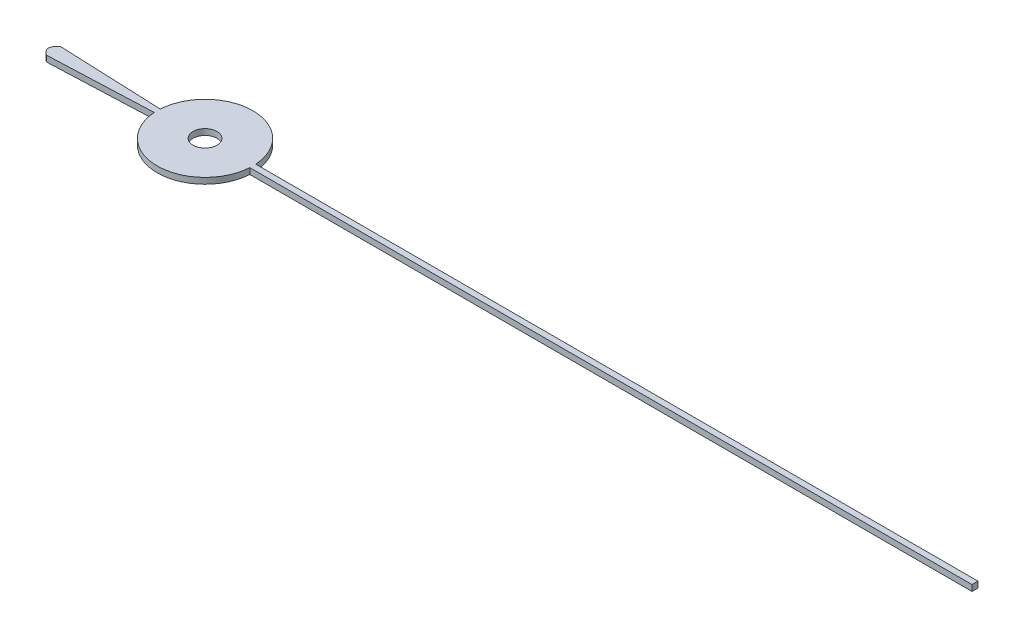
ISO-10303-21;
HEADER;
FILE_DESCRIPTION(('STEP AP214'),'2;1');
FILE_NAME('part.step','',(''),(''),'','','');
FILE_SCHEMA(('AUTOMOTIVE_DESIGN { 1 0 10303 214 1 1 1 1 }'));
ENDSEC;
DATA;
#1=APPLICATION_CONTEXT('core data for automotive mechanical design processes');
#2=APPLICATION_PROTOCOL_DEFINITION('international standard','automotive_design',2000,#1);
#3=PRODUCT_CONTEXT('',#1,'mechanical');
#4=PRODUCT('Part','Part','',(#3));
#5=PRODUCT_RELATED_PRODUCT_CATEGORY('part','',(#4));
#6=PRODUCT_DEFINITION_FORMATION('','',#4);
#7=PRODUCT_DEFINITION_CONTEXT('part definition',#1,'design');
#8=PRODUCT_DEFINITION('design','',#6,#7);
#9=PRODUCT_DEFINITION_SHAPE('','',#8);
#10=(LENGTH_UNIT() NAMED_UNIT(*) SI_UNIT(.MILLI.,.METRE.));
#11=(NAMED_UNIT(*) PLANE_ANGLE_UNIT() SI_UNIT($,.RADIAN.));
#12=(NAMED_UNIT(*) SI_UNIT($,.STERADIAN.) SOLID_ANGLE_UNIT());
#13=UNCERTAINTY_MEASURE_WITH_UNIT(LENGTH_MEASURE(1.E-05),#10,'distance_accuracy_value','');
#14=(GEOMETRIC_REPRESENTATION_CONTEXT(3) GLOBAL_UNCERTAINTY_ASSIGNED_CONTEXT((#13)) GLOBAL_UNIT_ASSIGNED_CONTEXT((#10,
#11,#12)) REPRESENTATION_CONTEXT('',''));
#15=CARTESIAN_POINT('',(0.,0.,0.));
#16=DIRECTION('',(0.,0.,1.));
#17=DIRECTION('',(1.,0.,0.));
#18=AXIS2_PLACEMENT_3D('',#15,#16,#17);
#19=CARTESIAN_POINT('',(-12.6777359801288,0.5,0.606260641219378));
#20=CARTESIAN_POINT('',(-13.5337899445866,0.5,0.));
#21=CARTESIAN_POINT('',(-12.6777359801288,0.5,-0.606260641219378));
#22=B_SPLINE_CURVE_WITH_KNOTS('',2,(#19,#20,#21),.UNSPECIFIED.,.F.,.F.,(3,3),(0.,1.),.UNSPECIFIED.);
#23=DIRECTION('',(0.,-1.,0.));
#24=VECTOR('',#23,1.);
#25=SURFACE_OF_LINEAR_EXTRUSION('',#22,#24);
#26=CARTESIAN_POINT('',(-12.6777359801288,0.,0.606260641219378));
#27=CARTESIAN_POINT('',(-13.5337899445866,0.,0.));
#28=CARTESIAN_POINT('',(-12.6777359801288,0.,-0.606260641219378));
#29=B_SPLINE_CURVE_WITH_KNOTS('',2,(#26,#27,#28),.UNSPECIFIED.,.F.,.F.,(3,3),(0.,1.),.UNSPECIFIED.);
#30=CARTESIAN_POINT('',(-12.6777359801288,0.,0.606260641219378));
#31=VERTEX_POINT('',#30);
#32=CARTESIAN_POINT('',(-12.6777359801288,0.,-0.606260641219378));
#33=VERTEX_POINT('',#32);
#34=EDGE_CURVE('E133',#31,#33,#29,.T.);
#35=ORIENTED_EDGE('',*,*,#34,.F.);
#36=DIRECTION('',(0.,-1.,0.));
#37=VECTOR('',#36,1.);
#38=CARTESIAN_POINT('',(-12.6777359801288,0.5,0.606260641219378));
#39=LINE('',#38,#37);
#40=CARTESIAN_POINT('',(-12.6777359801288,0.5,0.606260641219378));
#41=VERTEX_POINT('',#40);
#42=EDGE_CURVE('E11',#41,#31,#39,.T.);
#43=ORIENTED_EDGE('',*,*,#42,.F.);
#44=CARTESIAN_POINT('',(-12.6777359801288,0.5,-0.606260641219378));
#45=VERTEX_POINT('',#44);
#46=EDGE_CURVE('E155',#41,#45,#22,.T.);
#47=ORIENTED_EDGE('',*,*,#46,.T.);
#48=DIRECTION('',(0.,-1.,0.));
#49=VECTOR('',#48,1.);
#50=CARTESIAN_POINT('',(-12.6777359801288,0.5,-0.606260641219378));
#51=LINE('',#50,#49);
#52=EDGE_CURVE('E53',#45,#33,#51,.T.);
#53=ORIENTED_EDGE('',*,*,#52,.T.);
#54=EDGE_LOOP('',(#35,#43,#47,#53));
#55=FACE_BOUND('',#54,.T.);
#56=ADVANCED_FACE('F36',(#55),#25,.T.);
#57=CARTESIAN_POINT('',(0.00351580652269543,0.5,0.0856374160691493));
#58=DIRECTION('',(-0.041020006425208,0.,-0.999158325328311));
#59=DIRECTION('',(-0.999158325328312,0.,0.0410200064252081));
#60=AXIS2_PLACEMENT_3D('',#57,#58,#59);
#61=PLANE('',#60);
#62=DIRECTION('',(0.999158325328312,0.,-0.0410200064252081));
#63=VECTOR('',#62,1.);
#64=CARTESIAN_POINT('',(0.00351580652269543,0.,0.0856374160691493));
#65=LINE('',#64,#63);
#66=CARTESIAN_POINT('',(-4.,0.,0.25));
#67=VERTEX_POINT('',#66);
#68=EDGE_CURVE('E137',#31,#67,#65,.T.);
#69=ORIENTED_EDGE('',*,*,#68,.T.);
#70=DIRECTION('',(0.,-1.,0.));
#71=VECTOR('',#70,1.);
#72=CARTESIAN_POINT('',(-4.,0.5,0.25));
#73=LINE('',#72,#71);
#74=CARTESIAN_POINT('',(-4.,0.5,0.25));
#75=VERTEX_POINT('',#74);
#76=EDGE_CURVE('E45',#75,#67,#73,.T.);
#77=ORIENTED_EDGE('',*,*,#76,.F.);
#78=DIRECTION('',(0.999158325328312,0.,-0.0410200064252081));
#79=VECTOR('',#78,1.);
#80=CARTESIAN_POINT('',(0.00351580652269543,0.5,0.0856374160691493));
#81=LINE('',#80,#79);
#82=EDGE_CURVE('E265',#41,#75,#81,.T.);
#83=ORIENTED_EDGE('',*,*,#82,.F.);
#84=ORIENTED_EDGE('',*,*,#42,.T.);
#85=EDGE_LOOP('',(#69,#77,#83,#84));
#86=FACE_BOUND('',#85,.T.);
#87=ADVANCED_FACE('F195',(#86),#61,.F.);
#88=CARTESIAN_POINT('',(0.,0.5,0.));
#89=DIRECTION('',(0.,-1.,0.));
#90=DIRECTION('',(0.,0.,-1.));
#91=AXIS2_PLACEMENT_3D('',#88,#89,#90);
#92=CYLINDRICAL_SURFACE('',#91,4.00780488547035);
#93=CARTESIAN_POINT('',(0.,0.,0.));
#94=DIRECTION('',(0.,1.,0.));
#95=DIRECTION('',(0.,0.,1.));
#96=AXIS2_PLACEMENT_3D('',#93,#94,#95);
#97=CIRCLE('',#96,4.00780488547035);
#98=CARTESIAN_POINT('',(4.,0.,0.25));
#99=VERTEX_POINT('',#98);
#100=EDGE_CURVE('E143',#67,#99,#97,.T.);
#101=ORIENTED_EDGE('',*,*,#100,.T.);
#102=DIRECTION('',(0.,-1.,0.));
#103=VECTOR('',#102,1.);
#104=CARTESIAN_POINT('',(4.,0.5,0.25));
#105=LINE('',#104,#103);
#106=CARTESIAN_POINT('',(4.,0.5,0.25));
#107=VERTEX_POINT('',#106);
#108=EDGE_CURVE('E162',#107,#99,#105,.T.);
#109=ORIENTED_EDGE('',*,*,#108,.F.);
#110=CARTESIAN_POINT('',(0.,0.5,0.));
#111=DIRECTION('',(0.,1.,0.));
#112=DIRECTION('',(0.,0.,1.));
#113=AXIS2_PLACEMENT_3D('',#110,#111,#112);
#114=CIRCLE('',#113,4.00780488547035);
#115=EDGE_CURVE('E121',#75,#107,#114,.T.);
#116=ORIENTED_EDGE('',*,*,#115,.F.);
#117=ORIENTED_EDGE('',*,*,#76,.T.);
#118=EDGE_LOOP('',(#101,#109,#116,#117));
#119=FACE_BOUND('',#118,.T.);
#120=ADVANCED_FACE('F169',(#119),#92,.T.);
#121=CARTESIAN_POINT('',(0.,0.5,0.25));
#122=DIRECTION('',(0.,0.,-1.));
#123=DIRECTION('',(-1.,0.,0.));
#124=AXIS2_PLACEMENT_3D('',#121,#122,#123);
#125=PLANE('',#124);
#126=DIRECTION('',(1.,0.,0.));
#127=VECTOR('',#126,1.);
#128=CARTESIAN_POINT('',(0.,0.,0.25));
#129=LINE('',#128,#127);
#130=CARTESIAN_POINT('',(64.4873131542784,0.,0.25));
#131=VERTEX_POINT('',#130);
#132=EDGE_CURVE('E145',#99,#131,#129,.T.);
#133=ORIENTED_EDGE('',*,*,#132,.T.);
#134=DIRECTION('',(0.,-1.,0.));
#135=VECTOR('',#134,1.);
#136=CARTESIAN_POINT('',(64.4873131542784,0.5,0.25));
#137=LINE('',#136,#135);
#138=CARTESIAN_POINT('',(64.4873131542784,0.5,0.25));
#139=VERTEX_POINT('',#138);
#140=EDGE_CURVE('E159',#139,#131,#137,.T.);
#141=ORIENTED_EDGE('',*,*,#140,.F.);
#142=DIRECTION('',(1.,0.,0.));
#143=VECTOR('',#142,1.);
#144=CARTESIAN_POINT('',(0.,0.5,0.25));
#145=LINE('',#144,#143);
#146=EDGE_CURVE('E128',#107,#139,#145,.T.);
#147=ORIENTED_EDGE('',*,*,#146,.F.);
#148=ORIENTED_EDGE('',*,*,#108,.T.);
#149=EDGE_LOOP('',(#133,#141,#147,#148));
#150=FACE_BOUND('',#149,.T.);
#151=ADVANCED_FACE('F179',(#150),#125,.F.);
#152=CARTESIAN_POINT('',(64.4873131542784,0.5,0.));
#153=DIRECTION('',(-1.,0.,0.));
#154=DIRECTION('',(0.,0.,1.));
#155=AXIS2_PLACEMENT_3D('',#152,#153,#154);
#156=PLANE('',#155);
#157=DIRECTION('',(0.,0.,-1.));
#158=VECTOR('',#157,1.);
#159=CARTESIAN_POINT('',(64.4873131542784,0.,0.));
#160=LINE('',#159,#158);
#161=CARTESIAN_POINT('',(64.4873131542784,0.,-0.25));
#162=VERTEX_POINT('',#161);
#163=EDGE_CURVE('E148',#131,#162,#160,.T.);
#164=ORIENTED_EDGE('',*,*,#163,.T.);
#165=DIRECTION('',(0.,-1.,0.));
#166=VECTOR('',#165,1.);
#167=CARTESIAN_POINT('',(64.4873131542784,0.5,-0.25));
#168=LINE('',#167,#166);
#169=CARTESIAN_POINT('',(64.4873131542784,0.5,-0.25));
#170=VERTEX_POINT('',#169);
#171=EDGE_CURVE('E113',#170,#162,#168,.T.);
#172=ORIENTED_EDGE('',*,*,#171,.F.);
#173=DIRECTION('',(0.,0.,-1.));
#174=VECTOR('',#173,1.);
#175=CARTESIAN_POINT('',(64.4873131542784,0.5,0.));
#176=LINE('',#175,#174);
#177=EDGE_CURVE('E125',#139,#170,#176,.T.);
#178=ORIENTED_EDGE('',*,*,#177,.F.);
#179=ORIENTED_EDGE('',*,*,#140,.T.);
#180=EDGE_LOOP('',(#164,#172,#178,#179));
#181=FACE_BOUND('',#180,.T.);
#182=ADVANCED_FACE('F182',(#181),#156,.F.);
#183=CARTESIAN_POINT('',(0.,0.5,-0.25));
#184=DIRECTION('',(0.,0.,-1.));
#185=DIRECTION('',(-1.,0.,0.));
#186=AXIS2_PLACEMENT_3D('',#183,#184,#185);
#187=PLANE('',#186);
#188=DIRECTION('',(1.,0.,0.));
#189=VECTOR('',#188,1.);
#190=CARTESIAN_POINT('',(0.,0.,-0.25));
#191=LINE('',#190,#189);
#192=CARTESIAN_POINT('',(4.,0.,-0.25));
#193=VERTEX_POINT('',#192);
#194=EDGE_CURVE('E110',#193,#162,#191,.T.);
#195=ORIENTED_EDGE('',*,*,#194,.F.);
#196=DIRECTION('',(0.,-1.,0.));
#197=VECTOR('',#196,1.);
#198=CARTESIAN_POINT('',(4.,0.5,-0.25));
#199=LINE('',#198,#197);
#200=CARTESIAN_POINT('',(4.,0.5,-0.25));
#201=VERTEX_POINT('',#200);
#202=EDGE_CURVE('E104',#201,#193,#199,.T.);
#203=ORIENTED_EDGE('',*,*,#202,.F.);
#204=DIRECTION('',(1.,0.,0.));
#205=VECTOR('',#204,1.);
#206=CARTESIAN_POINT('',(0.,0.5,-0.25));
#207=LINE('',#206,#205);
#208=EDGE_CURVE('E108',#201,#170,#207,.T.);
#209=ORIENTED_EDGE('',*,*,#208,.T.);
#210=ORIENTED_EDGE('',*,*,#171,.T.);
#211=EDGE_LOOP('',(#195,#203,#209,#210));
#212=FACE_BOUND('',#211,.T.);
#213=ADVANCED_FACE('F106',(#212),#187,.T.);
#214=CARTESIAN_POINT('',(-4.,0.,-0.25));
#215=VERTEX_POINT('',#214);
#216=EDGE_CURVE('E146',#193,#215,#97,.T.);
#217=ORIENTED_EDGE('',*,*,#216,.T.);
#218=DIRECTION('',(0.,-1.,0.));
#219=VECTOR('',#218,1.);
#220=CARTESIAN_POINT('',(-4.,0.5,-0.25));
#221=LINE('',#220,#219);
#222=CARTESIAN_POINT('',(-4.,0.5,-0.25));
#223=VERTEX_POINT('',#222);
#224=EDGE_CURVE('E79',#223,#215,#221,.T.);
#225=ORIENTED_EDGE('',*,*,#224,.F.);
#226=EDGE_CURVE('E115',#201,#223,#114,.T.);
#227=ORIENTED_EDGE('',*,*,#226,.F.);
#228=ORIENTED_EDGE('',*,*,#202,.T.);
#229=EDGE_LOOP('',(#217,#225,#227,#228));
#230=FACE_BOUND('',#229,.T.);
#231=ADVANCED_FACE('F116',(#230),#92,.T.);
#232=CARTESIAN_POINT('',(0.00351580652269543,0.5,-0.0856374160691493));
#233=DIRECTION('',(0.041020006425208,0.,-0.999158325328311));
#234=DIRECTION('',(-0.999158325328312,0.,-0.0410200064252081));
#235=AXIS2_PLACEMENT_3D('',#232,#233,#234);
#236=PLANE('',#235);
#237=DIRECTION('',(0.999158325328312,0.,0.0410200064252081));
#238=VECTOR('',#237,1.);
#239=CARTESIAN_POINT('',(0.00351580652269543,0.,-0.0856374160691493));
#240=LINE('',#239,#238);
#241=EDGE_CURVE('E152',#33,#215,#240,.T.);
#242=ORIENTED_EDGE('',*,*,#241,.F.);
#243=ORIENTED_EDGE('',*,*,#52,.F.);
#244=DIRECTION('',(0.999158325328312,0.,0.0410200064252081));
#245=VECTOR('',#244,1.);
#246=CARTESIAN_POINT('',(0.00351580652269543,0.5,-0.0856374160691493));
#247=LINE('',#246,#245);
#248=EDGE_CURVE('E119',#45,#223,#247,.T.);
#249=ORIENTED_EDGE('',*,*,#248,.T.);
#250=ORIENTED_EDGE('',*,*,#224,.T.);
#251=EDGE_LOOP('',(#242,#243,#249,#250));
#252=FACE_BOUND('',#251,.T.);
#253=ADVANCED_FACE('F183',(#252),#236,.T.);
#254=CARTESIAN_POINT('',(0.,0.5,0.));
#255=DIRECTION('',(0.,1.,0.));
#256=DIRECTION('',(0.,0.,1.));
#257=AXIS2_PLACEMENT_3D('',#254,#255,#256);
#258=PLANE('',#257);
#259=CARTESIAN_POINT('',(0.,0.5,0.));
#260=DIRECTION('',(0.,1.,0.));
#261=DIRECTION('',(0.,0.,1.));
#262=AXIS2_PLACEMENT_3D('',#259,#260,#261);
#263=CIRCLE('',#262,1.);
#264=CARTESIAN_POINT('',(0.,0.5,1.));
#265=VERTEX_POINT('',#264);
#266=EDGE_CURVE('E258',#265,#265,#263,.T.);
#267=ORIENTED_EDGE('',*,*,#266,.F.);
#268=EDGE_LOOP('',(#267));
#269=FACE_BOUND('',#268,.T.);
#270=ORIENTED_EDGE('',*,*,#46,.F.);
#271=ORIENTED_EDGE('',*,*,#82,.T.);
#272=ORIENTED_EDGE('',*,*,#115,.T.);
#273=ORIENTED_EDGE('',*,*,#146,.T.);
#274=ORIENTED_EDGE('',*,*,#177,.T.);
#275=ORIENTED_EDGE('',*,*,#208,.F.);
#276=ORIENTED_EDGE('',*,*,#226,.T.);
#277=ORIENTED_EDGE('',*,*,#248,.F.);
#278=EDGE_LOOP('',(#270,#271,#272,#273,#274,#275,#276,#277));
#279=FACE_BOUND('',#278,.T.);
#280=ADVANCED_FACE('F123',(#269,#279),#258,.T.);
#281=CARTESIAN_POINT('',(0.,0.,0.));
#282=DIRECTION('',(0.,1.,0.));
#283=DIRECTION('',(0.,0.,1.));
#284=AXIS2_PLACEMENT_3D('',#281,#282,#283);
#285=PLANE('',#284);
#286=CARTESIAN_POINT('',(0.,0.,0.));
#287=DIRECTION('',(0.,1.,0.));
#288=DIRECTION('',(0.,0.,1.));
#289=AXIS2_PLACEMENT_3D('',#286,#287,#288);
#290=CIRCLE('',#289,1.);
#291=CARTESIAN_POINT('',(0.,0.,1.));
#292=VERTEX_POINT('',#291);
#293=EDGE_CURVE('E138',#292,#292,#290,.T.);
#294=ORIENTED_EDGE('',*,*,#293,.T.);
#295=EDGE_LOOP('',(#294));
#296=FACE_BOUND('',#295,.T.);
#297=ORIENTED_EDGE('',*,*,#34,.T.);
#298=ORIENTED_EDGE('',*,*,#241,.T.);
#299=ORIENTED_EDGE('',*,*,#216,.F.);
#300=ORIENTED_EDGE('',*,*,#194,.T.);
#301=ORIENTED_EDGE('',*,*,#163,.F.);
#302=ORIENTED_EDGE('',*,*,#132,.F.);
#303=ORIENTED_EDGE('',*,*,#100,.F.);
#304=ORIENTED_EDGE('',*,*,#68,.F.);
#305=EDGE_LOOP('',(#297,#298,#299,#300,#301,#302,#303,#304));
#306=FACE_BOUND('',#305,.T.);
#307=ADVANCED_FACE('F175',(#296,#306),#285,.F.);
#308=CARTESIAN_POINT('',(0.,0.,0.));
#309=DIRECTION('',(0.,1.,0.));
#310=DIRECTION('',(0.,0.,1.));
#311=AXIS2_PLACEMENT_3D('',#308,#309,#310);
#312=CYLINDRICAL_SURFACE('',#311,1.);
#313=ORIENTED_EDGE('',*,*,#293,.F.);
#314=EDGE_LOOP('',(#313));
#315=FACE_BOUND('',#314,.T.);
#316=ORIENTED_EDGE('',*,*,#266,.T.);
#317=EDGE_LOOP('',(#316));
#318=FACE_BOUND('',#317,.T.);
#319=ADVANCED_FACE('F239',(#315,#318),#312,.F.);
#320=CLOSED_SHELL('',(#56,#87,#120,#151,#182,#213,#231,#253,#280,#307,#319));
#321=MANIFOLD_SOLID_BREP('B2',#320);
#322=ADVANCED_BREP_SHAPE_REPRESENTATION('',(#18,#321),#14);
#323=SHAPE_DEFINITION_REPRESENTATION(#9,#322);
ENDSEC;
END-ISO-10303-21;
